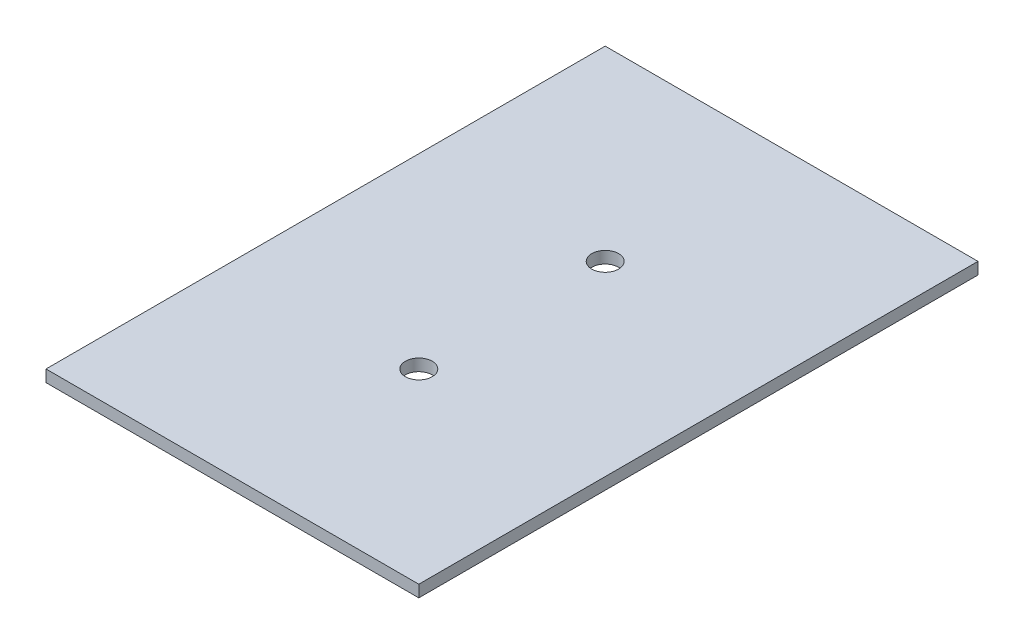
ISO-10303-21;
HEADER;
FILE_DESCRIPTION(('STEP AP214'),'2;1');
FILE_NAME('part.step','',(''),(''),'','','');
FILE_SCHEMA(('AUTOMOTIVE_DESIGN { 1 0 10303 214 1 1 1 1 }'));
ENDSEC;
DATA;
#1=APPLICATION_CONTEXT('core data for automotive mechanical design processes');
#2=APPLICATION_PROTOCOL_DEFINITION('international standard','automotive_design',2000,#1);
#3=PRODUCT_CONTEXT('',#1,'mechanical');
#4=PRODUCT('Part','Part','',(#3));
#5=PRODUCT_RELATED_PRODUCT_CATEGORY('part','',(#4));
#6=PRODUCT_DEFINITION_FORMATION('','',#4);
#7=PRODUCT_DEFINITION_CONTEXT('part definition',#1,'design');
#8=PRODUCT_DEFINITION('design','',#6,#7);
#9=PRODUCT_DEFINITION_SHAPE('','',#8);
#10=(LENGTH_UNIT() NAMED_UNIT(*) SI_UNIT(.MILLI.,.METRE.));
#11=(NAMED_UNIT(*) PLANE_ANGLE_UNIT() SI_UNIT($,.RADIAN.));
#12=(NAMED_UNIT(*) SI_UNIT($,.STERADIAN.) SOLID_ANGLE_UNIT());
#13=UNCERTAINTY_MEASURE_WITH_UNIT(LENGTH_MEASURE(1.E-05),#10,'distance_accuracy_value','');
#14=(GEOMETRIC_REPRESENTATION_CONTEXT(3) GLOBAL_UNCERTAINTY_ASSIGNED_CONTEXT((#13)) GLOBAL_UNIT_ASSIGNED_CONTEXT((#10,
#11,#12)) REPRESENTATION_CONTEXT('',''));
#15=CARTESIAN_POINT('',(0.,0.,0.));
#16=DIRECTION('',(0.,0.,1.));
#17=DIRECTION('',(1.,0.,0.));
#18=AXIS2_PLACEMENT_3D('',#15,#16,#17);
#19=CARTESIAN_POINT('',(22.,1.4,33.));
#20=DIRECTION('',(-1.,0.,0.));
#21=DIRECTION('',(0.,0.,1.));
#22=AXIS2_PLACEMENT_3D('',#19,#20,#21);
#23=PLANE('',#22);
#24=DIRECTION('',(0.,0.,-1.));
#25=VECTOR('',#24,1.);
#26=CARTESIAN_POINT('',(22.,0.,33.));
#27=LINE('',#26,#25);
#28=CARTESIAN_POINT('',(22.,0.,33.));
#29=VERTEX_POINT('',#28);
#30=CARTESIAN_POINT('',(22.,0.,-33.));
#31=VERTEX_POINT('',#30);
#32=EDGE_CURVE('E111',#29,#31,#27,.T.);
#33=ORIENTED_EDGE('',*,*,#32,.T.);
#34=DIRECTION('',(0.,-1.,0.));
#35=VECTOR('',#34,1.);
#36=CARTESIAN_POINT('',(22.,1.4,-33.));
#37=LINE('',#36,#35);
#38=CARTESIAN_POINT('',(22.,1.4,-33.));
#39=VERTEX_POINT('',#38);
#40=EDGE_CURVE('E11',#39,#31,#37,.T.);
#41=ORIENTED_EDGE('',*,*,#40,.F.);
#42=DIRECTION('',(0.,0.,-1.));
#43=VECTOR('',#42,1.);
#44=CARTESIAN_POINT('',(22.,1.4,33.));
#45=LINE('',#44,#43);
#46=CARTESIAN_POINT('',(22.,1.4,33.));
#47=VERTEX_POINT('',#46);
#48=EDGE_CURVE('E95',#47,#39,#45,.T.);
#49=ORIENTED_EDGE('',*,*,#48,.F.);
#50=DIRECTION('',(0.,-1.,0.));
#51=VECTOR('',#50,1.);
#52=CARTESIAN_POINT('',(22.,1.4,33.));
#53=LINE('',#52,#51);
#54=EDGE_CURVE('E107',#47,#29,#53,.T.);
#55=ORIENTED_EDGE('',*,*,#54,.T.);
#56=EDGE_LOOP('',(#33,#41,#49,#55));
#57=FACE_BOUND('',#56,.T.);
#58=ADVANCED_FACE('F43',(#57),#23,.F.);
#59=CARTESIAN_POINT('',(-22.,1.4,-33.));
#60=DIRECTION('',(0.,0.,1.));
#61=DIRECTION('',(1.,0.,0.));
#62=AXIS2_PLACEMENT_3D('',#59,#60,#61);
#63=PLANE('',#62);
#64=DIRECTION('',(-1.,0.,0.));
#65=VECTOR('',#64,1.);
#66=CARTESIAN_POINT('',(-22.,0.,-33.));
#67=LINE('',#66,#65);
#68=CARTESIAN_POINT('',(-22.,0.,-33.));
#69=VERTEX_POINT('',#68);
#70=EDGE_CURVE('E100',#31,#69,#67,.T.);
#71=ORIENTED_EDGE('',*,*,#70,.T.);
#72=DIRECTION('',(0.,-1.,0.));
#73=VECTOR('',#72,1.);
#74=CARTESIAN_POINT('',(-22.,1.4,-33.));
#75=LINE('',#74,#73);
#76=CARTESIAN_POINT('',(-22.,1.4,-33.));
#77=VERTEX_POINT('',#76);
#78=EDGE_CURVE('E52',#77,#69,#75,.T.);
#79=ORIENTED_EDGE('',*,*,#78,.F.);
#80=DIRECTION('',(-1.,0.,0.));
#81=VECTOR('',#80,1.);
#82=CARTESIAN_POINT('',(-22.,1.4,-33.));
#83=LINE('',#82,#81);
#84=EDGE_CURVE('E90',#39,#77,#83,.T.);
#85=ORIENTED_EDGE('',*,*,#84,.F.);
#86=ORIENTED_EDGE('',*,*,#40,.T.);
#87=EDGE_LOOP('',(#71,#79,#85,#86));
#88=FACE_BOUND('',#87,.T.);
#89=ADVANCED_FACE('F99',(#88),#63,.F.);
#90=CARTESIAN_POINT('',(-22.,1.4,33.));
#91=DIRECTION('',(1.,0.,0.));
#92=DIRECTION('',(0.,0.,-1.));
#93=AXIS2_PLACEMENT_3D('',#90,#91,#92);
#94=PLANE('',#93);
#95=DIRECTION('',(0.,0.,1.));
#96=VECTOR('',#95,1.);
#97=CARTESIAN_POINT('',(-22.,0.,33.));
#98=LINE('',#97,#96);
#99=CARTESIAN_POINT('',(-22.,0.,33.));
#100=VERTEX_POINT('',#99);
#101=EDGE_CURVE('E77',#69,#100,#98,.T.);
#102=ORIENTED_EDGE('',*,*,#101,.T.);
#103=DIRECTION('',(0.,-1.,0.));
#104=VECTOR('',#103,1.);
#105=CARTESIAN_POINT('',(-22.,1.4,33.));
#106=LINE('',#105,#104);
#107=CARTESIAN_POINT('',(-22.,1.4,33.));
#108=VERTEX_POINT('',#107);
#109=EDGE_CURVE('E102',#108,#100,#106,.T.);
#110=ORIENTED_EDGE('',*,*,#109,.F.);
#111=DIRECTION('',(0.,0.,1.));
#112=VECTOR('',#111,1.);
#113=CARTESIAN_POINT('',(-22.,1.4,33.));
#114=LINE('',#113,#112);
#115=EDGE_CURVE('E93',#77,#108,#114,.T.);
#116=ORIENTED_EDGE('',*,*,#115,.F.);
#117=ORIENTED_EDGE('',*,*,#78,.T.);
#118=EDGE_LOOP('',(#102,#110,#116,#117));
#119=FACE_BOUND('',#118,.T.);
#120=ADVANCED_FACE('F103',(#119),#94,.F.);
#121=CARTESIAN_POINT('',(-22.,1.4,33.));
#122=DIRECTION('',(0.,0.,-1.));
#123=DIRECTION('',(-1.,0.,0.));
#124=AXIS2_PLACEMENT_3D('',#121,#122,#123);
#125=PLANE('',#124);
#126=DIRECTION('',(1.,0.,0.));
#127=VECTOR('',#126,1.);
#128=CARTESIAN_POINT('',(-22.,0.,33.));
#129=LINE('',#128,#127);
#130=EDGE_CURVE('E83',#100,#29,#129,.T.);
#131=ORIENTED_EDGE('',*,*,#130,.T.);
#132=ORIENTED_EDGE('',*,*,#54,.F.);
#133=DIRECTION('',(1.,0.,0.));
#134=VECTOR('',#133,1.);
#135=CARTESIAN_POINT('',(-22.,1.4,33.));
#136=LINE('',#135,#134);
#137=EDGE_CURVE('E60',#108,#47,#136,.T.);
#138=ORIENTED_EDGE('',*,*,#137,.F.);
#139=ORIENTED_EDGE('',*,*,#109,.T.);
#140=EDGE_LOOP('',(#131,#132,#138,#139));
#141=FACE_BOUND('',#140,.T.);
#142=ADVANCED_FACE('F125',(#141),#125,.F.);
#143=CARTESIAN_POINT('',(0.,1.4,0.));
#144=DIRECTION('',(0.,-1.,0.));
#145=DIRECTION('',(0.,0.,-1.));
#146=AXIS2_PLACEMENT_3D('',#143,#144,#145);
#147=PLANE('',#146);
#148=CARTESIAN_POINT('',(0.,1.4,-11.));
#149=DIRECTION('',(0.,1.,0.));
#150=DIRECTION('',(0.,0.,1.));
#151=AXIS2_PLACEMENT_3D('',#148,#149,#150);
#152=CIRCLE('',#151,1.585);
#153=CARTESIAN_POINT('',(0.,1.4,-9.415));
#154=VERTEX_POINT('',#153);
#155=EDGE_CURVE('E140',#154,#154,#152,.T.);
#156=ORIENTED_EDGE('',*,*,#155,.F.);
#157=EDGE_LOOP('',(#156));
#158=FACE_BOUND('',#157,.T.);
#159=CARTESIAN_POINT('',(0.,1.4,11.));
#160=DIRECTION('',(0.,1.,0.));
#161=DIRECTION('',(0.,0.,1.));
#162=AXIS2_PLACEMENT_3D('',#159,#160,#161);
#163=CIRCLE('',#162,1.585);
#164=CARTESIAN_POINT('',(0.,1.4,12.585));
#165=VERTEX_POINT('',#164);
#166=EDGE_CURVE('E136',#165,#165,#163,.T.);
#167=ORIENTED_EDGE('',*,*,#166,.F.);
#168=EDGE_LOOP('',(#167));
#169=FACE_BOUND('',#168,.T.);
#170=ORIENTED_EDGE('',*,*,#48,.T.);
#171=ORIENTED_EDGE('',*,*,#84,.T.);
#172=ORIENTED_EDGE('',*,*,#115,.T.);
#173=ORIENTED_EDGE('',*,*,#137,.T.);
#174=EDGE_LOOP('',(#170,#171,#172,#173));
#175=FACE_BOUND('',#174,.T.);
#176=ADVANCED_FACE('F91',(#158,#169,#175),#147,.F.);
#177=CARTESIAN_POINT('',(0.,0.,0.));
#178=DIRECTION('',(0.,-1.,0.));
#179=DIRECTION('',(0.,0.,-1.));
#180=AXIS2_PLACEMENT_3D('',#177,#178,#179);
#181=PLANE('',#180);
#182=CARTESIAN_POINT('',(0.,0.,-11.));
#183=DIRECTION('',(0.,1.,0.));
#184=DIRECTION('',(0.,0.,1.));
#185=AXIS2_PLACEMENT_3D('',#182,#183,#184);
#186=CIRCLE('',#185,1.585);
#187=CARTESIAN_POINT('',(0.,0.,-9.415));
#188=VERTEX_POINT('',#187);
#189=EDGE_CURVE('E115',#188,#188,#186,.T.);
#190=ORIENTED_EDGE('',*,*,#189,.T.);
#191=EDGE_LOOP('',(#190));
#192=FACE_BOUND('',#191,.T.);
#193=CARTESIAN_POINT('',(0.,0.,11.));
#194=DIRECTION('',(0.,1.,0.));
#195=DIRECTION('',(0.,0.,1.));
#196=AXIS2_PLACEMENT_3D('',#193,#194,#195);
#197=CIRCLE('',#196,1.585);
#198=CARTESIAN_POINT('',(0.,0.,12.585));
#199=VERTEX_POINT('',#198);
#200=EDGE_CURVE('E132',#199,#199,#197,.T.);
#201=ORIENTED_EDGE('',*,*,#200,.T.);
#202=EDGE_LOOP('',(#201));
#203=FACE_BOUND('',#202,.T.);
#204=ORIENTED_EDGE('',*,*,#32,.F.);
#205=ORIENTED_EDGE('',*,*,#130,.F.);
#206=ORIENTED_EDGE('',*,*,#101,.F.);
#207=ORIENTED_EDGE('',*,*,#70,.F.);
#208=EDGE_LOOP('',(#204,#205,#206,#207));
#209=FACE_BOUND('',#208,.T.);
#210=ADVANCED_FACE('F128',(#192,#203,#209),#181,.T.);
#211=CARTESIAN_POINT('',(0.,0.,11.));
#212=DIRECTION('',(0.,1.,0.));
#213=DIRECTION('',(0.,0.,1.));
#214=AXIS2_PLACEMENT_3D('',#211,#212,#213);
#215=CYLINDRICAL_SURFACE('',#214,1.585);
#216=ORIENTED_EDGE('',*,*,#200,.F.);
#217=EDGE_LOOP('',(#216));
#218=FACE_BOUND('',#217,.T.);
#219=ORIENTED_EDGE('',*,*,#166,.T.);
#220=EDGE_LOOP('',(#219));
#221=FACE_BOUND('',#220,.T.);
#222=ADVANCED_FACE('F153',(#218,#221),#215,.F.);
#223=CARTESIAN_POINT('',(0.,0.,-11.));
#224=DIRECTION('',(0.,1.,0.));
#225=DIRECTION('',(0.,0.,1.));
#226=AXIS2_PLACEMENT_3D('',#223,#224,#225);
#227=CYLINDRICAL_SURFACE('',#226,1.585);
#228=ORIENTED_EDGE('',*,*,#189,.F.);
#229=EDGE_LOOP('',(#228));
#230=FACE_BOUND('',#229,.T.);
#231=ORIENTED_EDGE('',*,*,#155,.T.);
#232=EDGE_LOOP('',(#231));
#233=FACE_BOUND('',#232,.T.);
#234=ADVANCED_FACE('F150',(#230,#233),#227,.F.);
#235=CLOSED_SHELL('',(#58,#89,#120,#142,#176,#210,#222,#234));
#236=MANIFOLD_SOLID_BREP('B2',#235);
#237=ADVANCED_BREP_SHAPE_REPRESENTATION('',(#18,#236),#14);
#238=SHAPE_DEFINITION_REPRESENTATION(#9,#237);
ENDSEC;
END-ISO-10303-21;
